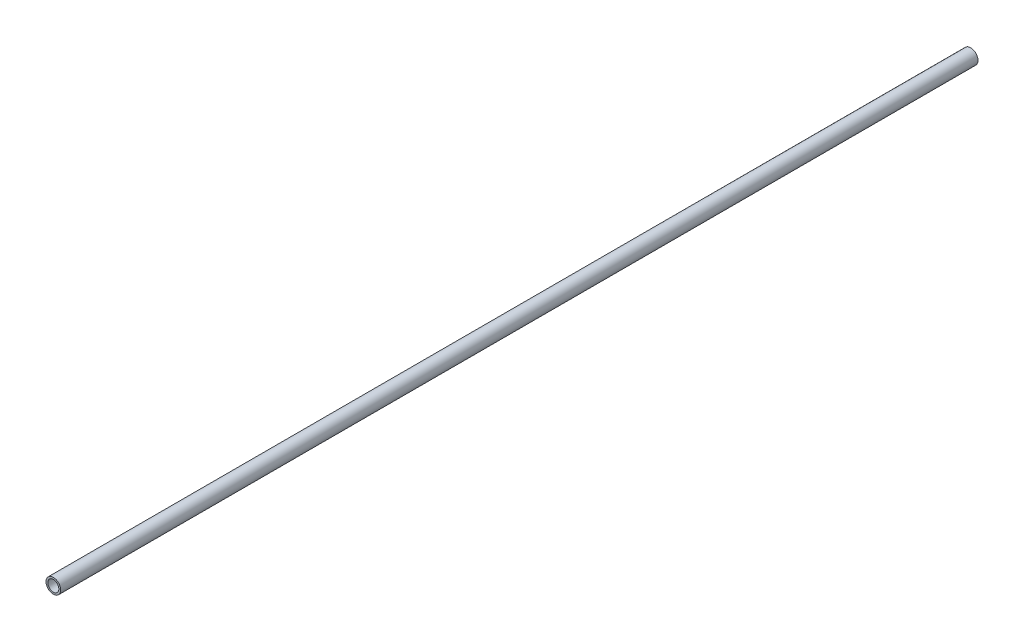
ISO-10303-21;
HEADER;
FILE_DESCRIPTION(('STEP AP214'),'2;1');
FILE_NAME('part.step','',(''),(''),'','','');
FILE_SCHEMA(('AUTOMOTIVE_DESIGN { 1 0 10303 214 1 1 1 1 }'));
ENDSEC;
DATA;
#1=APPLICATION_CONTEXT('core data for automotive mechanical design processes');
#2=APPLICATION_PROTOCOL_DEFINITION('international standard','automotive_design',2000,#1);
#3=PRODUCT_CONTEXT('',#1,'mechanical');
#4=PRODUCT('Part','Part','',(#3));
#5=PRODUCT_RELATED_PRODUCT_CATEGORY('part','',(#4));
#6=PRODUCT_DEFINITION_FORMATION('','',#4);
#7=PRODUCT_DEFINITION_CONTEXT('part definition',#1,'design');
#8=PRODUCT_DEFINITION('design','',#6,#7);
#9=PRODUCT_DEFINITION_SHAPE('','',#8);
#10=(LENGTH_UNIT() NAMED_UNIT(*) SI_UNIT(.MILLI.,.METRE.));
#11=(NAMED_UNIT(*) PLANE_ANGLE_UNIT() SI_UNIT($,.RADIAN.));
#12=(NAMED_UNIT(*) SI_UNIT($,.STERADIAN.) SOLID_ANGLE_UNIT());
#13=UNCERTAINTY_MEASURE_WITH_UNIT(LENGTH_MEASURE(1.E-05),#10,'distance_accuracy_value','');
#14=(GEOMETRIC_REPRESENTATION_CONTEXT(3) GLOBAL_UNCERTAINTY_ASSIGNED_CONTEXT((#13)) GLOBAL_UNIT_ASSIGNED_CONTEXT((#10,
#11,#12)) REPRESENTATION_CONTEXT('',''));
#15=CARTESIAN_POINT('',(0.,0.,0.));
#16=DIRECTION('',(0.,0.,1.));
#17=DIRECTION('',(1.,0.,0.));
#18=AXIS2_PLACEMENT_3D('',#15,#16,#17);
#19=CARTESIAN_POINT('',(0.,0.,250.));
#20=DIRECTION('',(0.,0.,1.));
#21=DIRECTION('',(1.,0.,0.));
#22=AXIS2_PLACEMENT_3D('',#19,#20,#21);
#23=PLANE('',#22);
#24=CARTESIAN_POINT('',(0.,0.,250.));
#25=DIRECTION('',(0.,0.,1.));
#26=DIRECTION('',(1.,0.,0.));
#27=AXIS2_PLACEMENT_3D('',#24,#25,#26);
#28=CIRCLE('',#27,2.);
#29=CARTESIAN_POINT('',(2.,0.,250.));
#30=VERTEX_POINT('',#29);
#31=EDGE_CURVE('E10',#30,#30,#28,.T.);
#32=ORIENTED_EDGE('',*,*,#31,.T.);
#33=EDGE_LOOP('',(#32));
#34=FACE_BOUND('',#33,.T.);
#35=CARTESIAN_POINT('',(0.,0.,250.));
#36=DIRECTION('',(0.,0.,1.));
#37=DIRECTION('',(1.,0.,0.));
#38=AXIS2_PLACEMENT_3D('',#35,#36,#37);
#39=CIRCLE('',#38,1.5);
#40=CARTESIAN_POINT('',(1.5,0.,250.));
#41=VERTEX_POINT('',#40);
#42=EDGE_CURVE('E50',#41,#41,#39,.T.);
#43=ORIENTED_EDGE('',*,*,#42,.F.);
#44=EDGE_LOOP('',(#43));
#45=FACE_BOUND('',#44,.T.);
#46=ADVANCED_FACE('F37',(#34,#45),#23,.T.);
#47=CARTESIAN_POINT('',(0.,0.,0.));
#48=DIRECTION('',(0.,0.,1.));
#49=DIRECTION('',(1.,0.,0.));
#50=AXIS2_PLACEMENT_3D('',#47,#48,#49);
#51=PLANE('',#50);
#52=CARTESIAN_POINT('',(0.,0.,0.));
#53=DIRECTION('',(0.,0.,1.));
#54=DIRECTION('',(1.,0.,0.));
#55=AXIS2_PLACEMENT_3D('',#52,#53,#54);
#56=CIRCLE('',#55,2.);
#57=CARTESIAN_POINT('',(2.,0.,0.));
#58=VERTEX_POINT('',#57);
#59=EDGE_CURVE('E41',#58,#58,#56,.T.);
#60=ORIENTED_EDGE('',*,*,#59,.F.);
#61=EDGE_LOOP('',(#60));
#62=FACE_BOUND('',#61,.T.);
#63=CARTESIAN_POINT('',(0.,0.,0.));
#64=DIRECTION('',(0.,0.,1.));
#65=DIRECTION('',(1.,0.,0.));
#66=AXIS2_PLACEMENT_3D('',#63,#64,#65);
#67=CIRCLE('',#66,1.5);
#68=CARTESIAN_POINT('',(1.5,0.,0.));
#69=VERTEX_POINT('',#68);
#70=EDGE_CURVE('E52',#69,#69,#67,.T.);
#71=ORIENTED_EDGE('',*,*,#70,.T.);
#72=EDGE_LOOP('',(#71));
#73=FACE_BOUND('',#72,.T.);
#74=ADVANCED_FACE('F64',(#62,#73),#51,.F.);
#75=CARTESIAN_POINT('',(0.,0.,250.));
#76=DIRECTION('',(0.,0.,-1.));
#77=DIRECTION('',(-1.,0.,0.));
#78=AXIS2_PLACEMENT_3D('',#75,#76,#77);
#79=CYLINDRICAL_SURFACE('',#78,2.);
#80=ORIENTED_EDGE('',*,*,#31,.F.);
#81=EDGE_LOOP('',(#80));
#82=FACE_BOUND('',#81,.T.);
#83=ORIENTED_EDGE('',*,*,#59,.T.);
#84=EDGE_LOOP('',(#83));
#85=FACE_BOUND('',#84,.T.);
#86=ADVANCED_FACE('F39',(#82,#85),#79,.T.);
#87=CARTESIAN_POINT('',(0.,0.,250.));
#88=DIRECTION('',(0.,0.,-1.));
#89=DIRECTION('',(-1.,0.,0.));
#90=AXIS2_PLACEMENT_3D('',#87,#88,#89);
#91=CYLINDRICAL_SURFACE('',#90,1.5);
#92=ORIENTED_EDGE('',*,*,#42,.T.);
#93=EDGE_LOOP('',(#92));
#94=FACE_BOUND('',#93,.T.);
#95=ORIENTED_EDGE('',*,*,#70,.F.);
#96=EDGE_LOOP('',(#95));
#97=FACE_BOUND('',#96,.T.);
#98=ADVANCED_FACE('F60',(#94,#97),#91,.F.);
#99=CLOSED_SHELL('',(#46,#74,#86,#98));
#100=MANIFOLD_SOLID_BREP('B2',#99);
#101=ADVANCED_BREP_SHAPE_REPRESENTATION('',(#18,#100),#14);
#102=SHAPE_DEFINITION_REPRESENTATION(#9,#101);
ENDSEC;
END-ISO-10303-21;
